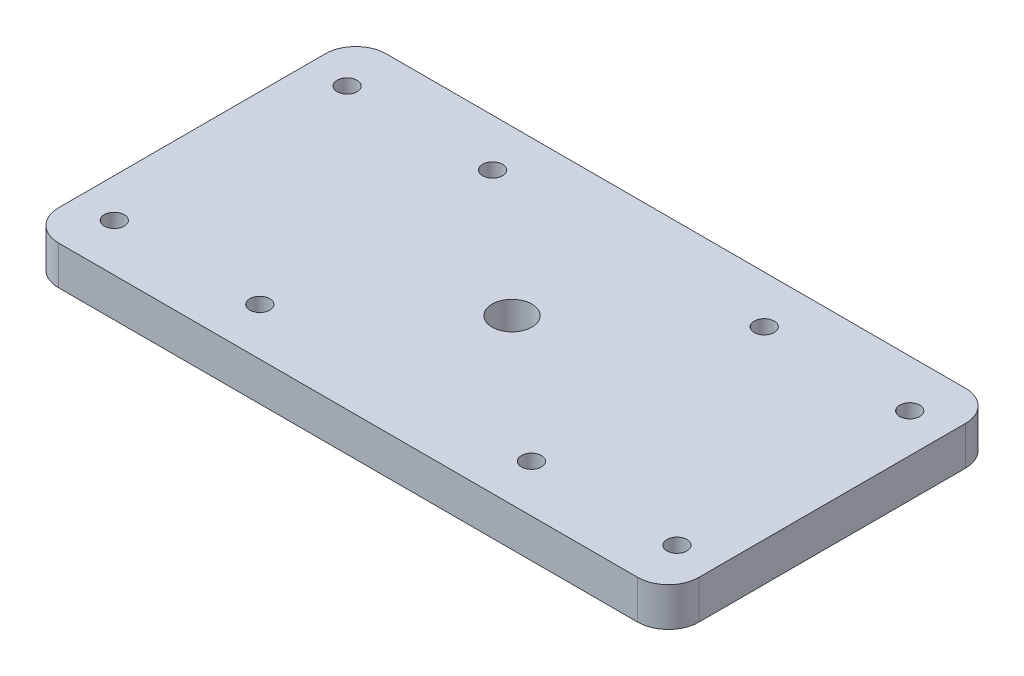
ISO-10303-21;
HEADER;
FILE_DESCRIPTION(('STEP AP214'),'2;1');
FILE_NAME('part.step','',(''),(''),'','','');
FILE_SCHEMA(('AUTOMOTIVE_DESIGN { 1 0 10303 214 1 1 1 1 }'));
ENDSEC;
DATA;
#1=APPLICATION_CONTEXT('core data for automotive mechanical design processes');
#2=APPLICATION_PROTOCOL_DEFINITION('international standard','automotive_design',2000,#1);
#3=PRODUCT_CONTEXT('',#1,'mechanical');
#4=PRODUCT('Part','Part','',(#3));
#5=PRODUCT_RELATED_PRODUCT_CATEGORY('part','',(#4));
#6=PRODUCT_DEFINITION_FORMATION('','',#4);
#7=PRODUCT_DEFINITION_CONTEXT('part definition',#1,'design');
#8=PRODUCT_DEFINITION('design','',#6,#7);
#9=PRODUCT_DEFINITION_SHAPE('','',#8);
#10=(LENGTH_UNIT() NAMED_UNIT(*) SI_UNIT(.MILLI.,.METRE.));
#11=(NAMED_UNIT(*) PLANE_ANGLE_UNIT() SI_UNIT($,.RADIAN.));
#12=(NAMED_UNIT(*) SI_UNIT($,.STERADIAN.) SOLID_ANGLE_UNIT());
#13=UNCERTAINTY_MEASURE_WITH_UNIT(LENGTH_MEASURE(1.E-05),#10,'distance_accuracy_value','');
#14=(GEOMETRIC_REPRESENTATION_CONTEXT(3) GLOBAL_UNCERTAINTY_ASSIGNED_CONTEXT((#13)) GLOBAL_UNIT_ASSIGNED_CONTEXT((#10,
#11,#12)) REPRESENTATION_CONTEXT('',''));
#15=CARTESIAN_POINT('',(0.,0.,0.));
#16=DIRECTION('',(0.,0.,1.));
#17=DIRECTION('',(1.,0.,0.));
#18=AXIS2_PLACEMENT_3D('',#15,#16,#17);
#19=CARTESIAN_POINT('',(0.,0.,0.));
#20=DIRECTION('',(0.,1.,0.));
#21=DIRECTION('',(0.,0.,1.));
#22=AXIS2_PLACEMENT_3D('',#19,#20,#21);
#23=PLANE('',#22);
#24=CARTESIAN_POINT('',(52.39,0.,-26.815));
#25=DIRECTION('',(0.,-1.,0.));
#26=DIRECTION('',(0.,0.,-1.));
#27=AXIS2_PLACEMENT_3D('',#24,#25,#26);
#28=CIRCLE('',#27,3.2639);
#29=CARTESIAN_POINT('',(52.39,0.,-30.0789));
#30=VERTEX_POINT('',#29);
#31=EDGE_CURVE('E229',#30,#30,#28,.T.);
#32=ORIENTED_EDGE('',*,*,#31,.F.);
#33=EDGE_LOOP('',(#32));
#34=FACE_BOUND('',#33,.T.);
#35=CARTESIAN_POINT('',(98.43,0.,-7.76500000000016));
#36=DIRECTION('',(0.,-1.,0.));
#37=DIRECTION('',(0.,0.,-1.));
#38=AXIS2_PLACEMENT_3D('',#35,#36,#37);
#39=CIRCLE('',#38,1.63194999999999);
#40=CARTESIAN_POINT('',(98.43,0.,-9.39695000000015));
#41=VERTEX_POINT('',#40);
#42=EDGE_CURVE('E223',#41,#41,#39,.T.);
#43=ORIENTED_EDGE('',*,*,#42,.F.);
#44=EDGE_LOOP('',(#43));
#45=FACE_BOUND('',#44,.T.);
#46=CARTESIAN_POINT('',(98.43,0.,-45.8650000000002));
#47=DIRECTION('',(0.,-1.,0.));
#48=DIRECTION('',(0.,0.,-1.));
#49=AXIS2_PLACEMENT_3D('',#46,#47,#48);
#50=CIRCLE('',#49,1.63194999999999);
#51=CARTESIAN_POINT('',(98.43,0.,-47.4969500000002));
#52=VERTEX_POINT('',#51);
#53=EDGE_CURVE('E217',#52,#52,#50,.T.);
#54=ORIENTED_EDGE('',*,*,#53,.F.);
#55=EDGE_LOOP('',(#54));
#56=FACE_BOUND('',#55,.T.);
#57=CARTESIAN_POINT('',(74.6175,0.,-7.76500000000019));
#58=DIRECTION('',(0.,-1.,0.));
#59=DIRECTION('',(0.,0.,-1.));
#60=AXIS2_PLACEMENT_3D('',#57,#58,#59);
#61=CIRCLE('',#60,1.63194999999999);
#62=CARTESIAN_POINT('',(74.6175,0.,-9.39695000000018));
#63=VERTEX_POINT('',#62);
#64=EDGE_CURVE('E211',#63,#63,#61,.T.);
#65=ORIENTED_EDGE('',*,*,#64,.F.);
#66=EDGE_LOOP('',(#65));
#67=FACE_BOUND('',#66,.T.);
#68=CARTESIAN_POINT('',(74.6175,0.,-45.8650000000002));
#69=DIRECTION('',(0.,-1.,0.));
#70=DIRECTION('',(0.,0.,-1.));
#71=AXIS2_PLACEMENT_3D('',#68,#69,#70);
#72=CIRCLE('',#71,1.63194999999999);
#73=CARTESIAN_POINT('',(74.6175,0.,-47.4969500000001));
#74=VERTEX_POINT('',#73);
#75=EDGE_CURVE('E205',#74,#74,#72,.T.);
#76=ORIENTED_EDGE('',*,*,#75,.F.);
#77=EDGE_LOOP('',(#76));
#78=FACE_BOUND('',#77,.T.);
#79=CARTESIAN_POINT('',(30.1675,0.,-7.76499999999999));
#80=DIRECTION('',(0.,-1.,0.));
#81=DIRECTION('',(0.,0.,-1.));
#82=AXIS2_PLACEMENT_3D('',#79,#80,#81);
#83=CIRCLE('',#82,1.63195);
#84=CARTESIAN_POINT('',(30.1675,0.,-9.39695));
#85=VERTEX_POINT('',#84);
#86=EDGE_CURVE('E199',#85,#85,#83,.T.);
#87=ORIENTED_EDGE('',*,*,#86,.F.);
#88=EDGE_LOOP('',(#87));
#89=FACE_BOUND('',#88,.T.);
#90=CARTESIAN_POINT('',(6.35500000000004,0.,-7.76500000000002));
#91=DIRECTION('',(0.,-1.,0.));
#92=DIRECTION('',(0.,0.,-1.));
#93=AXIS2_PLACEMENT_3D('',#90,#91,#92);
#94=CIRCLE('',#93,1.63195);
#95=CARTESIAN_POINT('',(6.35500000000004,0.,-9.39695000000002));
#96=VERTEX_POINT('',#95);
#97=EDGE_CURVE('E187',#96,#96,#94,.T.);
#98=ORIENTED_EDGE('',*,*,#97,.F.);
#99=EDGE_LOOP('',(#98));
#100=FACE_BOUND('',#99,.T.);
#101=CARTESIAN_POINT('',(6.35500000000004,0.,-45.865));
#102=DIRECTION('',(0.,-1.,0.));
#103=DIRECTION('',(0.,0.,-1.));
#104=AXIS2_PLACEMENT_3D('',#101,#102,#103);
#105=CIRCLE('',#104,1.63195);
#106=CARTESIAN_POINT('',(6.35500000000004,0.,-47.49695));
#107=VERTEX_POINT('',#106);
#108=EDGE_CURVE('E136',#107,#107,#105,.T.);
#109=ORIENTED_EDGE('',*,*,#108,.F.);
#110=EDGE_LOOP('',(#109));
#111=FACE_BOUND('',#110,.T.);
#112=DIRECTION('',(0.,0.,1.));
#113=VECTOR('',#112,1.);
#114=CARTESIAN_POINT('',(0.,0.,-53.63));
#115=LINE('',#114,#113);
#116=CARTESIAN_POINT('',(0.,0.,-48.63));
#117=VERTEX_POINT('',#116);
#118=CARTESIAN_POINT('',(0.,0.,-5.));
#119=VERTEX_POINT('',#118);
#120=EDGE_CURVE('E120',#117,#119,#115,.T.);
#121=ORIENTED_EDGE('',*,*,#120,.F.);
#122=CARTESIAN_POINT('',(5.,0.,-48.63));
#123=DIRECTION('',(0.,1.,0.));
#124=DIRECTION('',(0.,0.,1.));
#125=AXIS2_PLACEMENT_3D('',#122,#123,#124);
#126=CIRCLE('',#125,5.);
#127=CARTESIAN_POINT('',(5.,0.,-53.63));
#128=VERTEX_POINT('',#127);
#129=EDGE_CURVE('E103',#117,#128,#126,.F.);
#130=ORIENTED_EDGE('',*,*,#129,.T.);
#131=DIRECTION('',(-1.,0.,0.));
#132=VECTOR('',#131,1.);
#133=CARTESIAN_POINT('',(0.,0.,-53.63));
#134=LINE('',#133,#132);
#135=CARTESIAN_POINT('',(99.78,0.,-53.63));
#136=VERTEX_POINT('',#135);
#137=EDGE_CURVE('E143',#136,#128,#134,.T.);
#138=ORIENTED_EDGE('',*,*,#137,.F.);
#139=CARTESIAN_POINT('',(99.78,0.,-48.63));
#140=DIRECTION('',(0.,1.,0.));
#141=DIRECTION('',(0.,0.,1.));
#142=AXIS2_PLACEMENT_3D('',#139,#140,#141);
#143=CIRCLE('',#142,5.);
#144=CARTESIAN_POINT('',(104.78,0.,-48.63));
#145=VERTEX_POINT('',#144);
#146=EDGE_CURVE('E147',#136,#145,#143,.F.);
#147=ORIENTED_EDGE('',*,*,#146,.T.);
#148=DIRECTION('',(0.,0.,-1.));
#149=VECTOR('',#148,1.);
#150=CARTESIAN_POINT('',(104.78,0.,-53.63));
#151=LINE('',#150,#149);
#152=CARTESIAN_POINT('',(104.78,0.,-5.));
#153=VERTEX_POINT('',#152);
#154=EDGE_CURVE('E133',#153,#145,#151,.T.);
#155=ORIENTED_EDGE('',*,*,#154,.F.);
#156=CARTESIAN_POINT('',(99.78,0.,-5.));
#157=DIRECTION('',(0.,1.,0.));
#158=DIRECTION('',(0.,0.,1.));
#159=AXIS2_PLACEMENT_3D('',#156,#157,#158);
#160=CIRCLE('',#159,5.);
#161=CARTESIAN_POINT('',(99.78,0.,0.));
#162=VERTEX_POINT('',#161);
#163=EDGE_CURVE('E124',#153,#162,#160,.F.);
#164=ORIENTED_EDGE('',*,*,#163,.T.);
#165=DIRECTION('',(1.,0.,0.));
#166=VECTOR('',#165,1.);
#167=CARTESIAN_POINT('',(0.,0.,0.));
#168=LINE('',#167,#166);
#169=CARTESIAN_POINT('',(5.,0.,0.));
#170=VERTEX_POINT('',#169);
#171=EDGE_CURVE('E129',#170,#162,#168,.T.);
#172=ORIENTED_EDGE('',*,*,#171,.F.);
#173=CARTESIAN_POINT('',(5.,0.,-5.));
#174=DIRECTION('',(0.,1.,0.));
#175=DIRECTION('',(0.,0.,1.));
#176=AXIS2_PLACEMENT_3D('',#173,#174,#175);
#177=CIRCLE('',#176,5.);
#178=EDGE_CURVE('E114',#170,#119,#177,.F.);
#179=ORIENTED_EDGE('',*,*,#178,.T.);
#180=EDGE_LOOP('',(#121,#130,#138,#147,#155,#164,#172,#179));
#181=FACE_BOUND('',#180,.T.);
#182=CARTESIAN_POINT('',(30.1675,0.,-45.865));
#183=DIRECTION('',(0.,-1.,0.));
#184=DIRECTION('',(0.,0.,-1.));
#185=AXIS2_PLACEMENT_3D('',#182,#183,#184);
#186=CIRCLE('',#185,1.63195);
#187=CARTESIAN_POINT('',(30.1675,0.,-47.49695));
#188=VERTEX_POINT('',#187);
#189=EDGE_CURVE('E193',#188,#188,#186,.T.);
#190=ORIENTED_EDGE('',*,*,#189,.F.);
#191=EDGE_LOOP('',(#190));
#192=FACE_BOUND('',#191,.T.);
#193=ADVANCED_FACE('F38',(#34,#45,#56,#67,#78,#89,#100,#111,#181,#192),#23,.F.);
#194=CARTESIAN_POINT('',(0.,6.35,-53.63));
#195=DIRECTION('',(1.,0.,0.));
#196=DIRECTION('',(0.,0.,-1.));
#197=AXIS2_PLACEMENT_3D('',#194,#195,#196);
#198=PLANE('',#197);
#199=DIRECTION('',(0.,0.,1.));
#200=VECTOR('',#199,1.);
#201=CARTESIAN_POINT('',(0.,6.35,-53.63));
#202=LINE('',#201,#200);
#203=CARTESIAN_POINT('',(0.,6.35,-48.63));
#204=VERTEX_POINT('',#203);
#205=CARTESIAN_POINT('',(0.,6.35,-5.));
#206=VERTEX_POINT('',#205);
#207=EDGE_CURVE('E123',#204,#206,#202,.T.);
#208=ORIENTED_EDGE('',*,*,#207,.F.);
#209=DIRECTION('',(0.,-1.,0.));
#210=VECTOR('',#209,1.);
#211=CARTESIAN_POINT('',(0.,6.35,-48.63));
#212=LINE('',#211,#210);
#213=EDGE_CURVE('E107',#204,#117,#212,.T.);
#214=ORIENTED_EDGE('',*,*,#213,.T.);
#215=ORIENTED_EDGE('',*,*,#120,.T.);
#216=DIRECTION('',(0.,-1.,0.));
#217=VECTOR('',#216,1.);
#218=CARTESIAN_POINT('',(0.,6.35,-5.));
#219=LINE('',#218,#217);
#220=EDGE_CURVE('E125',#119,#206,#219,.F.);
#221=ORIENTED_EDGE('',*,*,#220,.T.);
#222=EDGE_LOOP('',(#208,#214,#215,#221));
#223=FACE_BOUND('',#222,.T.);
#224=ADVANCED_FACE('F119',(#223),#198,.F.);
#225=CARTESIAN_POINT('',(0.,6.35,0.));
#226=DIRECTION('',(0.,0.,-1.));
#227=DIRECTION('',(-1.,0.,0.));
#228=AXIS2_PLACEMENT_3D('',#225,#226,#227);
#229=PLANE('',#228);
#230=DIRECTION('',(1.,0.,0.));
#231=VECTOR('',#230,1.);
#232=CARTESIAN_POINT('',(0.,6.35,0.));
#233=LINE('',#232,#231);
#234=CARTESIAN_POINT('',(5.,6.35,0.));
#235=VERTEX_POINT('',#234);
#236=CARTESIAN_POINT('',(99.78,6.35,0.));
#237=VERTEX_POINT('',#236);
#238=EDGE_CURVE('E178',#235,#237,#233,.T.);
#239=ORIENTED_EDGE('',*,*,#238,.F.);
#240=DIRECTION('',(0.,-1.,0.));
#241=VECTOR('',#240,1.);
#242=CARTESIAN_POINT('',(5.,6.35,0.));
#243=LINE('',#242,#241);
#244=EDGE_CURVE('E162',#235,#170,#243,.T.);
#245=ORIENTED_EDGE('',*,*,#244,.T.);
#246=ORIENTED_EDGE('',*,*,#171,.T.);
#247=DIRECTION('',(0.,-1.,0.));
#248=VECTOR('',#247,1.);
#249=CARTESIAN_POINT('',(99.78,6.35,0.));
#250=LINE('',#249,#248);
#251=EDGE_CURVE('E160',#162,#237,#250,.F.);
#252=ORIENTED_EDGE('',*,*,#251,.T.);
#253=EDGE_LOOP('',(#239,#245,#246,#252));
#254=FACE_BOUND('',#253,.T.);
#255=ADVANCED_FACE('F274',(#254),#229,.F.);
#256=CARTESIAN_POINT('',(104.78,6.35,-53.63));
#257=DIRECTION('',(-1.,0.,0.));
#258=DIRECTION('',(0.,0.,1.));
#259=AXIS2_PLACEMENT_3D('',#256,#257,#258);
#260=PLANE('',#259);
#261=ORIENTED_EDGE('',*,*,#154,.T.);
#262=DIRECTION('',(0.,-1.,0.));
#263=VECTOR('',#262,1.);
#264=CARTESIAN_POINT('',(104.78,6.35,-48.63));
#265=LINE('',#264,#263);
#266=CARTESIAN_POINT('',(104.78,6.35,-48.63));
#267=VERTEX_POINT('',#266);
#268=EDGE_CURVE('E11',#145,#267,#265,.F.);
#269=ORIENTED_EDGE('',*,*,#268,.T.);
#270=DIRECTION('',(0.,0.,-1.));
#271=VECTOR('',#270,1.);
#272=CARTESIAN_POINT('',(104.78,6.35,-53.63));
#273=LINE('',#272,#271);
#274=CARTESIAN_POINT('',(104.78,6.35,-5.));
#275=VERTEX_POINT('',#274);
#276=EDGE_CURVE('E168',#275,#267,#273,.T.);
#277=ORIENTED_EDGE('',*,*,#276,.F.);
#278=DIRECTION('',(0.,-1.,0.));
#279=VECTOR('',#278,1.);
#280=CARTESIAN_POINT('',(104.78,6.35,-5.));
#281=LINE('',#280,#279);
#282=EDGE_CURVE('E46',#275,#153,#281,.T.);
#283=ORIENTED_EDGE('',*,*,#282,.T.);
#284=EDGE_LOOP('',(#261,#269,#277,#283));
#285=FACE_BOUND('',#284,.T.);
#286=ADVANCED_FACE('F167',(#285),#260,.F.);
#287=CARTESIAN_POINT('',(0.,6.35,-53.63));
#288=DIRECTION('',(0.,0.,1.));
#289=DIRECTION('',(1.,0.,0.));
#290=AXIS2_PLACEMENT_3D('',#287,#288,#289);
#291=PLANE('',#290);
#292=ORIENTED_EDGE('',*,*,#137,.T.);
#293=DIRECTION('',(0.,-1.,0.));
#294=VECTOR('',#293,1.);
#295=CARTESIAN_POINT('',(5.,6.35,-53.63));
#296=LINE('',#295,#294);
#297=CARTESIAN_POINT('',(5.,6.35,-53.63));
#298=VERTEX_POINT('',#297);
#299=EDGE_CURVE('E108',#128,#298,#296,.F.);
#300=ORIENTED_EDGE('',*,*,#299,.T.);
#301=DIRECTION('',(-1.,0.,0.));
#302=VECTOR('',#301,1.);
#303=CARTESIAN_POINT('',(0.,6.35,-53.63));
#304=LINE('',#303,#302);
#305=CARTESIAN_POINT('',(99.78,6.35,-53.63));
#306=VERTEX_POINT('',#305);
#307=EDGE_CURVE('E139',#306,#298,#304,.T.);
#308=ORIENTED_EDGE('',*,*,#307,.F.);
#309=DIRECTION('',(0.,-1.,0.));
#310=VECTOR('',#309,1.);
#311=CARTESIAN_POINT('',(99.78,6.35,-53.63));
#312=LINE('',#311,#310);
#313=EDGE_CURVE('E113',#306,#136,#312,.T.);
#314=ORIENTED_EDGE('',*,*,#313,.T.);
#315=EDGE_LOOP('',(#292,#300,#308,#314));
#316=FACE_BOUND('',#315,.T.);
#317=ADVANCED_FACE('F176',(#316),#291,.F.);
#318=CARTESIAN_POINT('',(0.,6.35,0.));
#319=DIRECTION('',(0.,1.,0.));
#320=DIRECTION('',(0.,0.,1.));
#321=AXIS2_PLACEMENT_3D('',#318,#319,#320);
#322=PLANE('',#321);
#323=CARTESIAN_POINT('',(52.39,6.35,-26.815));
#324=DIRECTION('',(0.,-1.,0.));
#325=DIRECTION('',(0.,0.,-1.));
#326=AXIS2_PLACEMENT_3D('',#323,#324,#325);
#327=CIRCLE('',#326,3.2639);
#328=CARTESIAN_POINT('',(52.39,6.35,-30.0789));
#329=VERTEX_POINT('',#328);
#330=EDGE_CURVE('E226',#329,#329,#327,.T.);
#331=ORIENTED_EDGE('',*,*,#330,.T.);
#332=EDGE_LOOP('',(#331));
#333=FACE_BOUND('',#332,.T.);
#334=CARTESIAN_POINT('',(98.43,6.35,-7.76500000000016));
#335=DIRECTION('',(0.,-1.,0.));
#336=DIRECTION('',(0.,0.,-1.));
#337=AXIS2_PLACEMENT_3D('',#334,#335,#336);
#338=CIRCLE('',#337,1.63194999999999);
#339=CARTESIAN_POINT('',(98.43,6.35,-9.39695000000015));
#340=VERTEX_POINT('',#339);
#341=EDGE_CURVE('E220',#340,#340,#338,.T.);
#342=ORIENTED_EDGE('',*,*,#341,.T.);
#343=EDGE_LOOP('',(#342));
#344=FACE_BOUND('',#343,.T.);
#345=CARTESIAN_POINT('',(98.43,6.35,-45.8650000000002));
#346=DIRECTION('',(0.,-1.,0.));
#347=DIRECTION('',(0.,0.,-1.));
#348=AXIS2_PLACEMENT_3D('',#345,#346,#347);
#349=CIRCLE('',#348,1.63194999999999);
#350=CARTESIAN_POINT('',(98.43,6.35,-47.4969500000002));
#351=VERTEX_POINT('',#350);
#352=EDGE_CURVE('E214',#351,#351,#349,.T.);
#353=ORIENTED_EDGE('',*,*,#352,.T.);
#354=EDGE_LOOP('',(#353));
#355=FACE_BOUND('',#354,.T.);
#356=CARTESIAN_POINT('',(74.6175,6.35,-7.76500000000019));
#357=DIRECTION('',(0.,-1.,0.));
#358=DIRECTION('',(0.,0.,-1.));
#359=AXIS2_PLACEMENT_3D('',#356,#357,#358);
#360=CIRCLE('',#359,1.63194999999999);
#361=CARTESIAN_POINT('',(74.6175,6.35,-9.39695000000018));
#362=VERTEX_POINT('',#361);
#363=EDGE_CURVE('E208',#362,#362,#360,.T.);
#364=ORIENTED_EDGE('',*,*,#363,.T.);
#365=EDGE_LOOP('',(#364));
#366=FACE_BOUND('',#365,.T.);
#367=CARTESIAN_POINT('',(74.6175,6.35,-45.8650000000002));
#368=DIRECTION('',(0.,-1.,0.));
#369=DIRECTION('',(0.,0.,-1.));
#370=AXIS2_PLACEMENT_3D('',#367,#368,#369);
#371=CIRCLE('',#370,1.63194999999999);
#372=CARTESIAN_POINT('',(74.6175,6.35,-47.4969500000001));
#373=VERTEX_POINT('',#372);
#374=EDGE_CURVE('E202',#373,#373,#371,.T.);
#375=ORIENTED_EDGE('',*,*,#374,.T.);
#376=EDGE_LOOP('',(#375));
#377=FACE_BOUND('',#376,.T.);
#378=CARTESIAN_POINT('',(30.1675,6.35,-7.76499999999999));
#379=DIRECTION('',(0.,-1.,0.));
#380=DIRECTION('',(0.,0.,-1.));
#381=AXIS2_PLACEMENT_3D('',#378,#379,#380);
#382=CIRCLE('',#381,1.63195);
#383=CARTESIAN_POINT('',(30.1675,6.35,-9.39695));
#384=VERTEX_POINT('',#383);
#385=EDGE_CURVE('E196',#384,#384,#382,.T.);
#386=ORIENTED_EDGE('',*,*,#385,.T.);
#387=EDGE_LOOP('',(#386));
#388=FACE_BOUND('',#387,.T.);
#389=CARTESIAN_POINT('',(30.1675,6.35,-45.865));
#390=DIRECTION('',(0.,-1.,0.));
#391=DIRECTION('',(0.,0.,-1.));
#392=AXIS2_PLACEMENT_3D('',#389,#390,#391);
#393=CIRCLE('',#392,1.63195);
#394=CARTESIAN_POINT('',(30.1675,6.35,-47.49695));
#395=VERTEX_POINT('',#394);
#396=EDGE_CURVE('E190',#395,#395,#393,.T.);
#397=ORIENTED_EDGE('',*,*,#396,.T.);
#398=EDGE_LOOP('',(#397));
#399=FACE_BOUND('',#398,.T.);
#400=CARTESIAN_POINT('',(6.35500000000004,6.35,-7.76500000000002));
#401=DIRECTION('',(0.,-1.,0.));
#402=DIRECTION('',(0.,0.,-1.));
#403=AXIS2_PLACEMENT_3D('',#400,#401,#402);
#404=CIRCLE('',#403,1.63195);
#405=CARTESIAN_POINT('',(6.35500000000004,6.35,-9.39695000000002));
#406=VERTEX_POINT('',#405);
#407=EDGE_CURVE('E184',#406,#406,#404,.T.);
#408=ORIENTED_EDGE('',*,*,#407,.T.);
#409=EDGE_LOOP('',(#408));
#410=FACE_BOUND('',#409,.T.);
#411=CARTESIAN_POINT('',(6.35500000000004,6.35,-45.865));
#412=DIRECTION('',(0.,-1.,0.));
#413=DIRECTION('',(0.,0.,-1.));
#414=AXIS2_PLACEMENT_3D('',#411,#412,#413);
#415=CIRCLE('',#414,1.63195);
#416=CARTESIAN_POINT('',(6.35500000000004,6.35,-47.49695));
#417=VERTEX_POINT('',#416);
#418=EDGE_CURVE('E130',#417,#417,#415,.T.);
#419=ORIENTED_EDGE('',*,*,#418,.T.);
#420=EDGE_LOOP('',(#419));
#421=FACE_BOUND('',#420,.T.);
#422=ORIENTED_EDGE('',*,*,#307,.T.);
#423=CARTESIAN_POINT('',(5.,6.35,-48.63));
#424=DIRECTION('',(0.,1.,0.));
#425=DIRECTION('',(0.,0.,1.));
#426=AXIS2_PLACEMENT_3D('',#423,#424,#425);
#427=CIRCLE('',#426,5.);
#428=EDGE_CURVE('E158',#298,#204,#427,.T.);
#429=ORIENTED_EDGE('',*,*,#428,.T.);
#430=ORIENTED_EDGE('',*,*,#207,.T.);
#431=CARTESIAN_POINT('',(5.,6.35,-5.));
#432=DIRECTION('',(0.,1.,0.));
#433=DIRECTION('',(0.,0.,1.));
#434=AXIS2_PLACEMENT_3D('',#431,#432,#433);
#435=CIRCLE('',#434,5.);
#436=EDGE_CURVE('E156',#206,#235,#435,.T.);
#437=ORIENTED_EDGE('',*,*,#436,.T.);
#438=ORIENTED_EDGE('',*,*,#238,.T.);
#439=CARTESIAN_POINT('',(99.78,6.35,-5.));
#440=DIRECTION('',(0.,1.,0.));
#441=DIRECTION('',(0.,0.,1.));
#442=AXIS2_PLACEMENT_3D('',#439,#440,#441);
#443=CIRCLE('',#442,5.);
#444=EDGE_CURVE('E58',#237,#275,#443,.T.);
#445=ORIENTED_EDGE('',*,*,#444,.T.);
#446=ORIENTED_EDGE('',*,*,#276,.T.);
#447=CARTESIAN_POINT('',(99.78,6.35,-48.63));
#448=DIRECTION('',(0.,1.,0.));
#449=DIRECTION('',(0.,0.,1.));
#450=AXIS2_PLACEMENT_3D('',#447,#448,#449);
#451=CIRCLE('',#450,5.);
#452=EDGE_CURVE('E154',#267,#306,#451,.T.);
#453=ORIENTED_EDGE('',*,*,#452,.T.);
#454=EDGE_LOOP('',(#422,#429,#430,#437,#438,#445,#446,#453));
#455=FACE_BOUND('',#454,.T.);
#456=ADVANCED_FACE('F255',(#333,#344,#355,#366,#377,#388,#399,#410,#421,#455),#322,.T.);
#457=CARTESIAN_POINT('',(6.35500000000004,0.,-45.865));
#458=DIRECTION('',(0.,-1.,0.));
#459=DIRECTION('',(0.,0.,-1.));
#460=AXIS2_PLACEMENT_3D('',#457,#458,#459);
#461=CYLINDRICAL_SURFACE('',#460,1.63195);
#462=ORIENTED_EDGE('',*,*,#418,.F.);
#463=EDGE_LOOP('',(#462));
#464=FACE_BOUND('',#463,.T.);
#465=ORIENTED_EDGE('',*,*,#108,.T.);
#466=EDGE_LOOP('',(#465));
#467=FACE_BOUND('',#466,.T.);
#468=ADVANCED_FACE('F252',(#464,#467),#461,.F.);
#469=CARTESIAN_POINT('',(6.35500000000004,0.,-7.76500000000002));
#470=DIRECTION('',(0.,-1.,0.));
#471=DIRECTION('',(0.,0.,-1.));
#472=AXIS2_PLACEMENT_3D('',#469,#470,#471);
#473=CYLINDRICAL_SURFACE('',#472,1.63195);
#474=ORIENTED_EDGE('',*,*,#407,.F.);
#475=EDGE_LOOP('',(#474));
#476=FACE_BOUND('',#475,.T.);
#477=ORIENTED_EDGE('',*,*,#97,.T.);
#478=EDGE_LOOP('',(#477));
#479=FACE_BOUND('',#478,.T.);
#480=ADVANCED_FACE('F254',(#476,#479),#473,.F.);
#481=CARTESIAN_POINT('',(30.1675,0.,-45.865));
#482=DIRECTION('',(0.,-1.,0.));
#483=DIRECTION('',(0.,0.,-1.));
#484=AXIS2_PLACEMENT_3D('',#481,#482,#483);
#485=CYLINDRICAL_SURFACE('',#484,1.63195);
#486=ORIENTED_EDGE('',*,*,#396,.F.);
#487=EDGE_LOOP('',(#486));
#488=FACE_BOUND('',#487,.T.);
#489=ORIENTED_EDGE('',*,*,#189,.T.);
#490=EDGE_LOOP('',(#489));
#491=FACE_BOUND('',#490,.T.);
#492=ADVANCED_FACE('F262',(#488,#491),#485,.F.);
#493=CARTESIAN_POINT('',(30.1675,0.,-7.76499999999999));
#494=DIRECTION('',(0.,-1.,0.));
#495=DIRECTION('',(0.,0.,-1.));
#496=AXIS2_PLACEMENT_3D('',#493,#494,#495);
#497=CYLINDRICAL_SURFACE('',#496,1.63195);
#498=ORIENTED_EDGE('',*,*,#385,.F.);
#499=EDGE_LOOP('',(#498));
#500=FACE_BOUND('',#499,.T.);
#501=ORIENTED_EDGE('',*,*,#86,.T.);
#502=EDGE_LOOP('',(#501));
#503=FACE_BOUND('',#502,.T.);
#504=ADVANCED_FACE('F397',(#500,#503),#497,.F.);
#505=CARTESIAN_POINT('',(74.6175,0.,-45.8650000000002));
#506=DIRECTION('',(0.,-1.,0.));
#507=DIRECTION('',(0.,0.,-1.));
#508=AXIS2_PLACEMENT_3D('',#505,#506,#507);
#509=CYLINDRICAL_SURFACE('',#508,1.63194999999999);
#510=ORIENTED_EDGE('',*,*,#374,.F.);
#511=EDGE_LOOP('',(#510));
#512=FACE_BOUND('',#511,.T.);
#513=ORIENTED_EDGE('',*,*,#75,.T.);
#514=EDGE_LOOP('',(#513));
#515=FACE_BOUND('',#514,.T.);
#516=ADVANCED_FACE('F387',(#512,#515),#509,.F.);
#517=CARTESIAN_POINT('',(74.6175,0.,-7.76500000000019));
#518=DIRECTION('',(0.,-1.,0.));
#519=DIRECTION('',(0.,0.,-1.));
#520=AXIS2_PLACEMENT_3D('',#517,#518,#519);
#521=CYLINDRICAL_SURFACE('',#520,1.63194999999999);
#522=ORIENTED_EDGE('',*,*,#363,.F.);
#523=EDGE_LOOP('',(#522));
#524=FACE_BOUND('',#523,.T.);
#525=ORIENTED_EDGE('',*,*,#64,.T.);
#526=EDGE_LOOP('',(#525));
#527=FACE_BOUND('',#526,.T.);
#528=ADVANCED_FACE('F377',(#524,#527),#521,.F.);
#529=CARTESIAN_POINT('',(98.43,0.,-45.8650000000002));
#530=DIRECTION('',(0.,-1.,0.));
#531=DIRECTION('',(0.,0.,-1.));
#532=AXIS2_PLACEMENT_3D('',#529,#530,#531);
#533=CYLINDRICAL_SURFACE('',#532,1.63194999999999);
#534=ORIENTED_EDGE('',*,*,#352,.F.);
#535=EDGE_LOOP('',(#534));
#536=FACE_BOUND('',#535,.T.);
#537=ORIENTED_EDGE('',*,*,#53,.T.);
#538=EDGE_LOOP('',(#537));
#539=FACE_BOUND('',#538,.T.);
#540=ADVANCED_FACE('F367',(#536,#539),#533,.F.);
#541=CARTESIAN_POINT('',(98.43,0.,-7.76500000000016));
#542=DIRECTION('',(0.,-1.,0.));
#543=DIRECTION('',(0.,0.,-1.));
#544=AXIS2_PLACEMENT_3D('',#541,#542,#543);
#545=CYLINDRICAL_SURFACE('',#544,1.63194999999999);
#546=ORIENTED_EDGE('',*,*,#341,.F.);
#547=EDGE_LOOP('',(#546));
#548=FACE_BOUND('',#547,.T.);
#549=ORIENTED_EDGE('',*,*,#42,.T.);
#550=EDGE_LOOP('',(#549));
#551=FACE_BOUND('',#550,.T.);
#552=ADVANCED_FACE('F357',(#548,#551),#545,.F.);
#553=CARTESIAN_POINT('',(52.39,0.,-26.815));
#554=DIRECTION('',(0.,-1.,0.));
#555=DIRECTION('',(0.,0.,-1.));
#556=AXIS2_PLACEMENT_3D('',#553,#554,#555);
#557=CYLINDRICAL_SURFACE('',#556,3.2639);
#558=ORIENTED_EDGE('',*,*,#330,.F.);
#559=EDGE_LOOP('',(#558));
#560=FACE_BOUND('',#559,.T.);
#561=ORIENTED_EDGE('',*,*,#31,.T.);
#562=EDGE_LOOP('',(#561));
#563=FACE_BOUND('',#562,.T.);
#564=ADVANCED_FACE('F233',(#560,#563),#557,.F.);
#565=CARTESIAN_POINT('',(5.,6.35,-48.63));
#566=DIRECTION('',(0.,-1.,0.));
#567=DIRECTION('',(0.,0.,-1.));
#568=AXIS2_PLACEMENT_3D('',#565,#566,#567);
#569=CYLINDRICAL_SURFACE('',#568,5.);
#570=ORIENTED_EDGE('',*,*,#428,.F.);
#571=ORIENTED_EDGE('',*,*,#299,.F.);
#572=ORIENTED_EDGE('',*,*,#129,.F.);
#573=ORIENTED_EDGE('',*,*,#213,.F.);
#574=EDGE_LOOP('',(#570,#571,#572,#573));
#575=FACE_BOUND('',#574,.T.);
#576=ADVANCED_FACE('F106',(#575),#569,.T.);
#577=CARTESIAN_POINT('',(5.,6.35,-5.));
#578=DIRECTION('',(0.,-1.,0.));
#579=DIRECTION('',(0.,0.,-1.));
#580=AXIS2_PLACEMENT_3D('',#577,#578,#579);
#581=CYLINDRICAL_SURFACE('',#580,5.);
#582=ORIENTED_EDGE('',*,*,#436,.F.);
#583=ORIENTED_EDGE('',*,*,#220,.F.);
#584=ORIENTED_EDGE('',*,*,#178,.F.);
#585=ORIENTED_EDGE('',*,*,#244,.F.);
#586=EDGE_LOOP('',(#582,#583,#584,#585));
#587=FACE_BOUND('',#586,.T.);
#588=ADVANCED_FACE('F282',(#587),#581,.T.);
#589=CARTESIAN_POINT('',(99.78,6.35,-48.63));
#590=DIRECTION('',(0.,-1.,0.));
#591=DIRECTION('',(0.,0.,-1.));
#592=AXIS2_PLACEMENT_3D('',#589,#590,#591);
#593=CYLINDRICAL_SURFACE('',#592,5.);
#594=ORIENTED_EDGE('',*,*,#452,.F.);
#595=ORIENTED_EDGE('',*,*,#268,.F.);
#596=ORIENTED_EDGE('',*,*,#146,.F.);
#597=ORIENTED_EDGE('',*,*,#313,.F.);
#598=EDGE_LOOP('',(#594,#595,#596,#597));
#599=FACE_BOUND('',#598,.T.);
#600=ADVANCED_FACE('F173',(#599),#593,.T.);
#601=CARTESIAN_POINT('',(99.78,6.35,-5.));
#602=DIRECTION('',(0.,-1.,0.));
#603=DIRECTION('',(0.,0.,-1.));
#604=AXIS2_PLACEMENT_3D('',#601,#602,#603);
#605=CYLINDRICAL_SURFACE('',#604,5.);
#606=ORIENTED_EDGE('',*,*,#444,.F.);
#607=ORIENTED_EDGE('',*,*,#251,.F.);
#608=ORIENTED_EDGE('',*,*,#163,.F.);
#609=ORIENTED_EDGE('',*,*,#282,.F.);
#610=EDGE_LOOP('',(#606,#607,#608,#609));
#611=FACE_BOUND('',#610,.T.);
#612=ADVANCED_FACE('F40',(#611),#605,.T.);
#613=CLOSED_SHELL('',(#193,#224,#255,#286,#317,#456,#468,#480,#492,#504,#516,#528,#540,#552,
#564,#576,#588,#600,#612));
#614=MANIFOLD_SOLID_BREP('B2',#613);
#615=ADVANCED_BREP_SHAPE_REPRESENTATION('',(#18,#614),#14);
#616=SHAPE_DEFINITION_REPRESENTATION(#9,#615);
ENDSEC;
END-ISO-10303-21;
